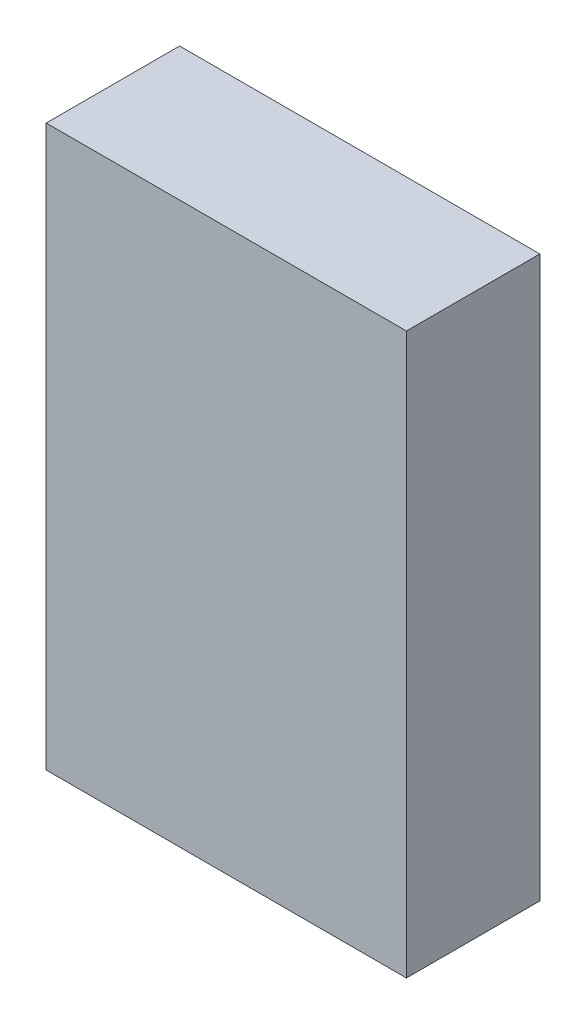
ISO-10303-21;
HEADER;
FILE_DESCRIPTION(('STEP AP214'),'2;1');
FILE_NAME('part.step','',(''),(''),'','','');
FILE_SCHEMA(('AUTOMOTIVE_DESIGN { 1 0 10303 214 1 1 1 1 }'));
ENDSEC;
DATA;
#1=APPLICATION_CONTEXT('core data for automotive mechanical design processes');
#2=APPLICATION_PROTOCOL_DEFINITION('international standard','automotive_design',2000,#1);
#3=PRODUCT_CONTEXT('',#1,'mechanical');
#4=PRODUCT('Part','Part','',(#3));
#5=PRODUCT_RELATED_PRODUCT_CATEGORY('part','',(#4));
#6=PRODUCT_DEFINITION_FORMATION('','',#4);
#7=PRODUCT_DEFINITION_CONTEXT('part definition',#1,'design');
#8=PRODUCT_DEFINITION('design','',#6,#7);
#9=PRODUCT_DEFINITION_SHAPE('','',#8);
#10=(LENGTH_UNIT() NAMED_UNIT(*) SI_UNIT(.MILLI.,.METRE.));
#11=(NAMED_UNIT(*) PLANE_ANGLE_UNIT() SI_UNIT($,.RADIAN.));
#12=(NAMED_UNIT(*) SI_UNIT($,.STERADIAN.) SOLID_ANGLE_UNIT());
#13=UNCERTAINTY_MEASURE_WITH_UNIT(LENGTH_MEASURE(1.E-05),#10,'distance_accuracy_value','');
#14=(GEOMETRIC_REPRESENTATION_CONTEXT(3) GLOBAL_UNCERTAINTY_ASSIGNED_CONTEXT((#13)) GLOBAL_UNIT_ASSIGNED_CONTEXT((#10,
#11,#12)) REPRESENTATION_CONTEXT('',''));
#15=CARTESIAN_POINT('',(0.,0.,0.));
#16=DIRECTION('',(0.,0.,1.));
#17=DIRECTION('',(1.,0.,0.));
#18=AXIS2_PLACEMENT_3D('',#15,#16,#17);
#19=CARTESIAN_POINT('',(0.,0.,0.499999));
#20=DIRECTION('',(0.,0.,-1.));
#21=DIRECTION('',(-1.,0.,0.));
#22=AXIS2_PLACEMENT_3D('',#19,#20,#21);
#23=PLANE('',#22);
#24=DIRECTION('',(1.,0.,0.));
#25=VECTOR('',#24,1.);
#26=CARTESIAN_POINT('',(0.67499992,-1.05000044,0.499999));
#27=LINE('',#26,#25);
#28=CARTESIAN_POINT('',(0.67499992,-1.05000044,0.499999));
#29=VERTEX_POINT('',#28);
#30=CARTESIAN_POINT('',(-0.67499992,-1.05000044,0.499999));
#31=VERTEX_POINT('',#30);
#32=EDGE_CURVE('E68',#29,#31,#27,.F.);
#33=ORIENTED_EDGE('',*,*,#32,.F.);
#34=DIRECTION('',(0.,1.,0.));
#35=VECTOR('',#34,1.);
#36=CARTESIAN_POINT('',(0.67499992,1.05000044,0.499999));
#37=LINE('',#36,#35);
#38=CARTESIAN_POINT('',(0.67499992,1.05000044,0.499999));
#39=VERTEX_POINT('',#38);
#40=EDGE_CURVE('E55',#39,#29,#37,.F.);
#41=ORIENTED_EDGE('',*,*,#40,.F.);
#42=DIRECTION('',(1.,0.,0.));
#43=VECTOR('',#42,1.);
#44=CARTESIAN_POINT('',(-0.67499992,1.05000044,0.499999));
#45=LINE('',#44,#43);
#46=CARTESIAN_POINT('',(-0.67499992,1.05000044,0.499999));
#47=VERTEX_POINT('',#46);
#48=EDGE_CURVE('E20',#47,#39,#45,.T.);
#49=ORIENTED_EDGE('',*,*,#48,.F.);
#50=DIRECTION('',(0.,1.,0.));
#51=VECTOR('',#50,1.);
#52=CARTESIAN_POINT('',(-0.67499992,-1.05000044,0.499999));
#53=LINE('',#52,#51);
#54=EDGE_CURVE('E80',#31,#47,#53,.T.);
#55=ORIENTED_EDGE('',*,*,#54,.F.);
#56=EDGE_LOOP('',(#33,#41,#49,#55));
#57=FACE_BOUND('',#56,.T.);
#58=ADVANCED_FACE('F17',(#57),#23,.F.);
#59=CARTESIAN_POINT('',(-0.67499992,1.05000044,0.));
#60=DIRECTION('',(0.,1.,0.));
#61=DIRECTION('',(0.,0.,1.));
#62=AXIS2_PLACEMENT_3D('',#59,#60,#61);
#63=PLANE('',#62);
#64=DIRECTION('',(0.,0.,-1.));
#65=VECTOR('',#64,1.);
#66=CARTESIAN_POINT('',(0.67499992,1.05000044,0.));
#67=LINE('',#66,#65);
#68=CARTESIAN_POINT('',(0.67499992,1.05000044,0.));
#69=VERTEX_POINT('',#68);
#70=EDGE_CURVE('E61',#69,#39,#67,.F.);
#71=ORIENTED_EDGE('',*,*,#70,.F.);
#72=DIRECTION('',(-1.,0.,0.));
#73=VECTOR('',#72,1.);
#74=CARTESIAN_POINT('',(0.,1.05000044,0.));
#75=LINE('',#74,#73);
#76=CARTESIAN_POINT('',(-0.67499992,1.05000044,0.));
#77=VERTEX_POINT('',#76);
#78=EDGE_CURVE('E83',#77,#69,#75,.F.);
#79=ORIENTED_EDGE('',*,*,#78,.F.);
#80=DIRECTION('',(0.,0.,1.));
#81=VECTOR('',#80,1.);
#82=CARTESIAN_POINT('',(-0.67499992,1.05000044,0.));
#83=LINE('',#82,#81);
#84=EDGE_CURVE('E64',#47,#77,#83,.F.);
#85=ORIENTED_EDGE('',*,*,#84,.F.);
#86=ORIENTED_EDGE('',*,*,#48,.T.);
#87=EDGE_LOOP('',(#71,#79,#85,#86));
#88=FACE_BOUND('',#87,.T.);
#89=ADVANCED_FACE('F60',(#88),#63,.T.);
#90=CARTESIAN_POINT('',(0.67499992,1.05000044,0.));
#91=DIRECTION('',(1.,0.,0.));
#92=DIRECTION('',(0.,0.,-1.));
#93=AXIS2_PLACEMENT_3D('',#90,#91,#92);
#94=PLANE('',#93);
#95=DIRECTION('',(0.,0.,-1.));
#96=VECTOR('',#95,1.);
#97=CARTESIAN_POINT('',(0.67499992,-1.05000044,0.));
#98=LINE('',#97,#96);
#99=CARTESIAN_POINT('',(0.67499992,-1.05000044,0.));
#100=VERTEX_POINT('',#99);
#101=EDGE_CURVE('E70',#100,#29,#98,.F.);
#102=ORIENTED_EDGE('',*,*,#101,.F.);
#103=DIRECTION('',(0.,1.,0.));
#104=VECTOR('',#103,1.);
#105=CARTESIAN_POINT('',(0.67499992,0.,0.));
#106=LINE('',#105,#104);
#107=EDGE_CURVE('E74',#69,#100,#106,.F.);
#108=ORIENTED_EDGE('',*,*,#107,.F.);
#109=ORIENTED_EDGE('',*,*,#70,.T.);
#110=ORIENTED_EDGE('',*,*,#40,.T.);
#111=EDGE_LOOP('',(#102,#108,#109,#110));
#112=FACE_BOUND('',#111,.T.);
#113=ADVANCED_FACE('F72',(#112),#94,.T.);
#114=CARTESIAN_POINT('',(0.67499992,-1.05000044,0.));
#115=DIRECTION('',(0.,-1.,0.));
#116=DIRECTION('',(0.,0.,-1.));
#117=AXIS2_PLACEMENT_3D('',#114,#115,#116);
#118=PLANE('',#117);
#119=DIRECTION('',(0.,0.,1.));
#120=VECTOR('',#119,1.);
#121=CARTESIAN_POINT('',(-0.67499992,-1.05000044,0.));
#122=LINE('',#121,#120);
#123=CARTESIAN_POINT('',(-0.67499992,-1.05000044,0.));
#124=VERTEX_POINT('',#123);
#125=EDGE_CURVE('E35',#124,#31,#122,.T.);
#126=ORIENTED_EDGE('',*,*,#125,.F.);
#127=DIRECTION('',(-1.,0.,0.));
#128=VECTOR('',#127,1.);
#129=CARTESIAN_POINT('',(0.,-1.05000044,0.));
#130=LINE('',#129,#128);
#131=EDGE_CURVE('E26',#100,#124,#130,.T.);
#132=ORIENTED_EDGE('',*,*,#131,.F.);
#133=ORIENTED_EDGE('',*,*,#101,.T.);
#134=ORIENTED_EDGE('',*,*,#32,.T.);
#135=EDGE_LOOP('',(#126,#132,#133,#134));
#136=FACE_BOUND('',#135,.T.);
#137=ADVANCED_FACE('F89',(#136),#118,.T.);
#138=CARTESIAN_POINT('',(-0.67499992,-1.05000044,0.));
#139=DIRECTION('',(-1.,0.,0.));
#140=DIRECTION('',(0.,0.,1.));
#141=AXIS2_PLACEMENT_3D('',#138,#139,#140);
#142=PLANE('',#141);
#143=ORIENTED_EDGE('',*,*,#84,.T.);
#144=DIRECTION('',(0.,1.,0.));
#145=VECTOR('',#144,1.);
#146=CARTESIAN_POINT('',(-0.67499992,0.,0.));
#147=LINE('',#146,#145);
#148=EDGE_CURVE('E11',#124,#77,#147,.T.);
#149=ORIENTED_EDGE('',*,*,#148,.F.);
#150=ORIENTED_EDGE('',*,*,#125,.T.);
#151=ORIENTED_EDGE('',*,*,#54,.T.);
#152=EDGE_LOOP('',(#143,#149,#150,#151));
#153=FACE_BOUND('',#152,.T.);
#154=ADVANCED_FACE('F91',(#153),#142,.T.);
#155=CARTESIAN_POINT('',(0.,0.,0.));
#156=DIRECTION('',(0.,0.,-1.));
#157=DIRECTION('',(-1.,0.,0.));
#158=AXIS2_PLACEMENT_3D('',#155,#156,#157);
#159=PLANE('',#158);
#160=ORIENTED_EDGE('',*,*,#131,.T.);
#161=ORIENTED_EDGE('',*,*,#148,.T.);
#162=ORIENTED_EDGE('',*,*,#78,.T.);
#163=ORIENTED_EDGE('',*,*,#107,.T.);
#164=EDGE_LOOP('',(#160,#161,#162,#163));
#165=FACE_BOUND('',#164,.T.);
#166=ADVANCED_FACE('F88',(#165),#159,.T.);
#167=CLOSED_SHELL('',(#58,#89,#113,#137,#154,#166));
#168=MANIFOLD_SOLID_BREP('B1',#167);
#169=ADVANCED_BREP_SHAPE_REPRESENTATION('',(#18,#168),#14);
#170=SHAPE_DEFINITION_REPRESENTATION(#9,#169);
ENDSEC;
END-ISO-10303-21;
